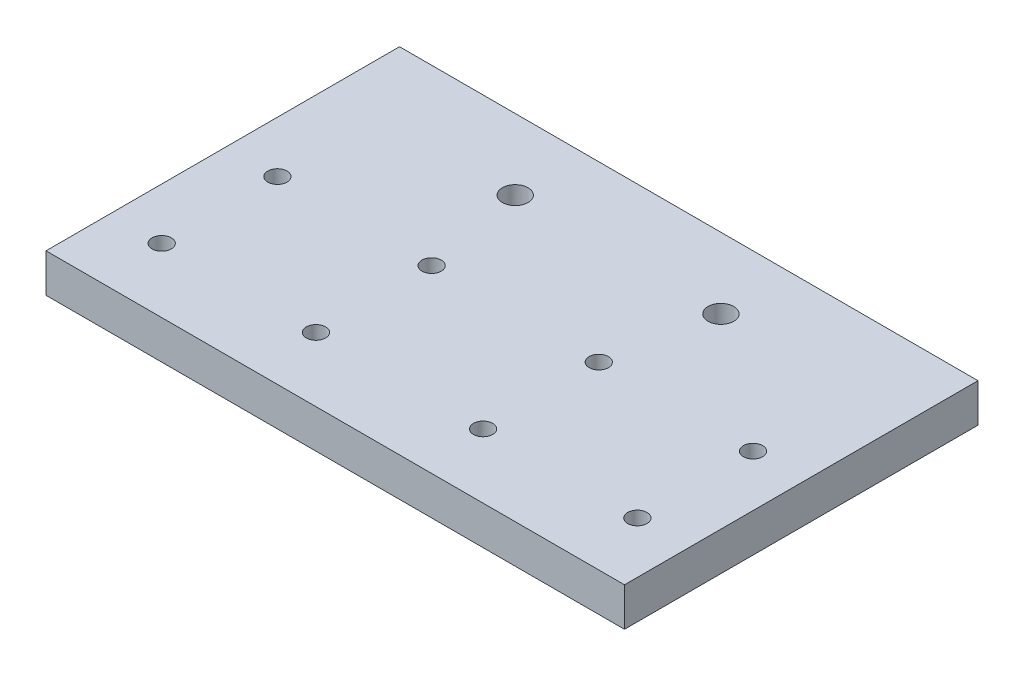
ISO-10303-21;
HEADER;
FILE_DESCRIPTION(('STEP AP214'),'2;1');
FILE_NAME('part.step','',(''),(''),'','','');
FILE_SCHEMA(('AUTOMOTIVE_DESIGN { 1 0 10303 214 1 1 1 1 }'));
ENDSEC;
DATA;
#1=APPLICATION_CONTEXT('core data for automotive mechanical design processes');
#2=APPLICATION_PROTOCOL_DEFINITION('international standard','automotive_design',2000,#1);
#3=PRODUCT_CONTEXT('',#1,'mechanical');
#4=PRODUCT('Part','Part','',(#3));
#5=PRODUCT_RELATED_PRODUCT_CATEGORY('part','',(#4));
#6=PRODUCT_DEFINITION_FORMATION('','',#4);
#7=PRODUCT_DEFINITION_CONTEXT('part definition',#1,'design');
#8=PRODUCT_DEFINITION('design','',#6,#7);
#9=PRODUCT_DEFINITION_SHAPE('','',#8);
#10=(LENGTH_UNIT() NAMED_UNIT(*) SI_UNIT(.MILLI.,.METRE.));
#11=(NAMED_UNIT(*) PLANE_ANGLE_UNIT() SI_UNIT($,.RADIAN.));
#12=(NAMED_UNIT(*) SI_UNIT($,.STERADIAN.) SOLID_ANGLE_UNIT());
#13=UNCERTAINTY_MEASURE_WITH_UNIT(LENGTH_MEASURE(1.E-05),#10,'distance_accuracy_value','');
#14=(GEOMETRIC_REPRESENTATION_CONTEXT(3) GLOBAL_UNCERTAINTY_ASSIGNED_CONTEXT((#13)) GLOBAL_UNIT_ASSIGNED_CONTEXT((#10,
#11,#12)) REPRESENTATION_CONTEXT('',''));
#15=CARTESIAN_POINT('',(0.,0.,0.));
#16=DIRECTION('',(0.,0.,1.));
#17=DIRECTION('',(1.,0.,0.));
#18=AXIS2_PLACEMENT_3D('',#15,#16,#17);
#19=CARTESIAN_POINT('',(0.,6.,0.));
#20=DIRECTION('',(0.,1.,0.));
#21=DIRECTION('',(0.,0.,1.));
#22=AXIS2_PLACEMENT_3D('',#19,#20,#21);
#23=PLANE('',#22);
#24=CARTESIAN_POINT('',(15.999999999977,6.,-18.9999999999857));
#25=DIRECTION('',(0.,1.,0.));
#26=DIRECTION('',(0.,0.,1.));
#27=AXIS2_PLACEMENT_3D('',#24,#25,#26);
#28=CIRCLE('',#27,2.00000000000001);
#29=CARTESIAN_POINT('',(15.999999999977,6.,-16.9999999999857));
#30=VERTEX_POINT('',#29);
#31=EDGE_CURVE('E163',#30,#30,#28,.T.);
#32=ORIENTED_EDGE('',*,*,#31,.F.);
#33=EDGE_LOOP('',(#32));
#34=FACE_BOUND('',#33,.T.);
#35=CARTESIAN_POINT('',(-15.9999999999771,6.,-18.9999999999857));
#36=DIRECTION('',(0.,1.,0.));
#37=DIRECTION('',(0.,0.,-1.));
#38=AXIS2_PLACEMENT_3D('',#35,#36,#37);
#39=CIRCLE('',#38,2.00000000000001);
#40=CARTESIAN_POINT('',(-15.9999999999771,6.,-20.9999999999857));
#41=VERTEX_POINT('',#40);
#42=EDGE_CURVE('E164',#41,#41,#39,.T.);
#43=ORIENTED_EDGE('',*,*,#42,.F.);
#44=EDGE_LOOP('',(#43));
#45=FACE_BOUND('',#44,.T.);
#46=CARTESIAN_POINT('',(-13.0000000000002,6.,15.));
#47=DIRECTION('',(0.,1.,0.));
#48=DIRECTION('',(0.,0.,1.));
#49=AXIS2_PLACEMENT_3D('',#46,#47,#48);
#50=CIRCLE('',#49,1.49999999999746);
#51=CARTESIAN_POINT('',(-13.0000000000002,6.,16.4999999999975));
#52=VERTEX_POINT('',#51);
#53=EDGE_CURVE('E145',#52,#52,#50,.T.);
#54=ORIENTED_EDGE('',*,*,#53,.F.);
#55=EDGE_LOOP('',(#54));
#56=FACE_BOUND('',#55,.T.);
#57=CARTESIAN_POINT('',(-37.0000000000002,6.,15.));
#58=DIRECTION('',(0.,1.,0.));
#59=DIRECTION('',(0.,0.,-1.));
#60=AXIS2_PLACEMENT_3D('',#57,#58,#59);
#61=CIRCLE('',#60,1.5);
#62=CARTESIAN_POINT('',(-37.0000000000002,6.,13.5));
#63=VERTEX_POINT('',#62);
#64=EDGE_CURVE('E133',#63,#63,#61,.T.);
#65=ORIENTED_EDGE('',*,*,#64,.F.);
#66=EDGE_LOOP('',(#65));
#67=FACE_BOUND('',#66,.T.);
#68=CARTESIAN_POINT('',(37.0000000000002,6.,15.));
#69=DIRECTION('',(0.,1.,0.));
#70=DIRECTION('',(0.,0.,1.));
#71=AXIS2_PLACEMENT_3D('',#68,#69,#70);
#72=CIRCLE('',#71,1.5);
#73=CARTESIAN_POINT('',(37.0000000000002,6.,16.5));
#74=VERTEX_POINT('',#73);
#75=EDGE_CURVE('E121',#74,#74,#72,.T.);
#76=ORIENTED_EDGE('',*,*,#75,.F.);
#77=EDGE_LOOP('',(#76));
#78=FACE_BOUND('',#77,.T.);
#79=CARTESIAN_POINT('',(37.,6.,-3.));
#80=DIRECTION('',(0.,1.,0.));
#81=DIRECTION('',(0.,0.,1.));
#82=AXIS2_PLACEMENT_3D('',#79,#80,#81);
#83=CIRCLE('',#82,1.5);
#84=CARTESIAN_POINT('',(37.,6.,-1.49999999999999));
#85=VERTEX_POINT('',#84);
#86=EDGE_CURVE('E100',#85,#85,#83,.T.);
#87=ORIENTED_EDGE('',*,*,#86,.F.);
#88=EDGE_LOOP('',(#87));
#89=FACE_BOUND('',#88,.T.);
#90=DIRECTION('',(0.,0.,-1.));
#91=VECTOR('',#90,1.);
#92=CARTESIAN_POINT('',(45.,6.,-30.));
#93=LINE('',#92,#91);
#94=CARTESIAN_POINT('',(45.,6.,25.));
#95=VERTEX_POINT('',#94);
#96=CARTESIAN_POINT('',(45.,6.,-30.));
#97=VERTEX_POINT('',#96);
#98=EDGE_CURVE('E85',#95,#97,#93,.T.);
#99=ORIENTED_EDGE('',*,*,#98,.T.);
#100=DIRECTION('',(-1.,0.,0.));
#101=VECTOR('',#100,1.);
#102=CARTESIAN_POINT('',(-45.,6.,-30.));
#103=LINE('',#102,#101);
#104=CARTESIAN_POINT('',(-45.,6.,-30.));
#105=VERTEX_POINT('',#104);
#106=EDGE_CURVE('E80',#97,#105,#103,.T.);
#107=ORIENTED_EDGE('',*,*,#106,.T.);
#108=DIRECTION('',(0.,0.,1.));
#109=VECTOR('',#108,1.);
#110=CARTESIAN_POINT('',(-45.,6.,-30.));
#111=LINE('',#110,#109);
#112=CARTESIAN_POINT('',(-45.,6.,25.));
#113=VERTEX_POINT('',#112);
#114=EDGE_CURVE('E83',#105,#113,#111,.T.);
#115=ORIENTED_EDGE('',*,*,#114,.T.);
#116=DIRECTION('',(1.,0.,0.));
#117=VECTOR('',#116,1.);
#118=CARTESIAN_POINT('',(-45.,6.,25.));
#119=LINE('',#118,#117);
#120=EDGE_CURVE('E50',#113,#95,#119,.T.);
#121=ORIENTED_EDGE('',*,*,#120,.T.);
#122=EDGE_LOOP('',(#99,#107,#115,#121));
#123=FACE_BOUND('',#122,.T.);
#124=CARTESIAN_POINT('',(13.,6.,-3.));
#125=DIRECTION('',(0.,1.,0.));
#126=DIRECTION('',(0.,0.,-1.));
#127=AXIS2_PLACEMENT_3D('',#124,#125,#126);
#128=CIRCLE('',#127,1.49999999999747);
#129=CARTESIAN_POINT('',(13.,6.,-4.49999999999747));
#130=VERTEX_POINT('',#129);
#131=EDGE_CURVE('E115',#130,#130,#128,.T.);
#132=ORIENTED_EDGE('',*,*,#131,.F.);
#133=EDGE_LOOP('',(#132));
#134=FACE_BOUND('',#133,.T.);
#135=CARTESIAN_POINT('',(13.0000000000002,6.,15.));
#136=DIRECTION('',(0.,1.,0.));
#137=DIRECTION('',(0.,0.,-1.));
#138=AXIS2_PLACEMENT_3D('',#135,#136,#137);
#139=CIRCLE('',#138,1.49999999999747);
#140=CARTESIAN_POINT('',(13.0000000000002,6.,13.5000000000025));
#141=VERTEX_POINT('',#140);
#142=EDGE_CURVE('E127',#141,#141,#139,.T.);
#143=ORIENTED_EDGE('',*,*,#142,.F.);
#144=EDGE_LOOP('',(#143));
#145=FACE_BOUND('',#144,.T.);
#146=CARTESIAN_POINT('',(-37.,6.,-3.));
#147=DIRECTION('',(0.,1.,0.));
#148=DIRECTION('',(0.,0.,-1.));
#149=AXIS2_PLACEMENT_3D('',#146,#147,#148);
#150=CIRCLE('',#149,1.5);
#151=CARTESIAN_POINT('',(-37.,6.,-4.5));
#152=VERTEX_POINT('',#151);
#153=EDGE_CURVE('E139',#152,#152,#150,.T.);
#154=ORIENTED_EDGE('',*,*,#153,.F.);
#155=EDGE_LOOP('',(#154));
#156=FACE_BOUND('',#155,.T.);
#157=CARTESIAN_POINT('',(-13.,6.,-3.));
#158=DIRECTION('',(0.,1.,0.));
#159=DIRECTION('',(0.,0.,1.));
#160=AXIS2_PLACEMENT_3D('',#157,#158,#159);
#161=CIRCLE('',#160,1.49999999999746);
#162=CARTESIAN_POINT('',(-13.,6.,-1.50000000000253));
#163=VERTEX_POINT('',#162);
#164=EDGE_CURVE('E151',#163,#163,#161,.T.);
#165=ORIENTED_EDGE('',*,*,#164,.F.);
#166=EDGE_LOOP('',(#165));
#167=FACE_BOUND('',#166,.T.);
#168=ADVANCED_FACE('F33',(#34,#45,#56,#67,#78,#89,#123,#134,#145,#156,#167),#23,.T.);
#169=CARTESIAN_POINT('',(0.,0.,0.));
#170=DIRECTION('',(0.,1.,0.));
#171=DIRECTION('',(0.,0.,1.));
#172=AXIS2_PLACEMENT_3D('',#169,#170,#171);
#173=PLANE('',#172);
#174=CARTESIAN_POINT('',(15.999999999977,0.,-18.9999999999857));
#175=DIRECTION('',(0.,1.,0.));
#176=DIRECTION('',(0.,0.,1.));
#177=AXIS2_PLACEMENT_3D('',#174,#175,#176);
#178=CIRCLE('',#177,2.00000000000001);
#179=CARTESIAN_POINT('',(15.999999999977,0.,-16.9999999999857));
#180=VERTEX_POINT('',#179);
#181=EDGE_CURVE('E157',#180,#180,#178,.F.);
#182=ORIENTED_EDGE('',*,*,#181,.F.);
#183=EDGE_LOOP('',(#182));
#184=FACE_BOUND('',#183,.T.);
#185=CARTESIAN_POINT('',(-15.9999999999771,0.,-18.9999999999857));
#186=DIRECTION('',(0.,1.,0.));
#187=DIRECTION('',(0.,0.,1.));
#188=AXIS2_PLACEMENT_3D('',#185,#186,#187);
#189=CIRCLE('',#188,2.00000000000001);
#190=CARTESIAN_POINT('',(-15.9999999999771,0.,-16.9999999999857));
#191=VERTEX_POINT('',#190);
#192=EDGE_CURVE('E160',#191,#191,#189,.F.);
#193=ORIENTED_EDGE('',*,*,#192,.F.);
#194=EDGE_LOOP('',(#193));
#195=FACE_BOUND('',#194,.T.);
#196=DIRECTION('',(0.,0.,-1.));
#197=VECTOR('',#196,1.);
#198=CARTESIAN_POINT('',(45.,0.,-30.));
#199=LINE('',#198,#197);
#200=CARTESIAN_POINT('',(45.,0.,25.));
#201=VERTEX_POINT('',#200);
#202=CARTESIAN_POINT('',(45.,0.,-30.));
#203=VERTEX_POINT('',#202);
#204=EDGE_CURVE('E97',#201,#203,#199,.T.);
#205=ORIENTED_EDGE('',*,*,#204,.F.);
#206=DIRECTION('',(1.,0.,0.));
#207=VECTOR('',#206,1.);
#208=CARTESIAN_POINT('',(-45.,0.,25.));
#209=LINE('',#208,#207);
#210=CARTESIAN_POINT('',(-45.,0.,25.));
#211=VERTEX_POINT('',#210);
#212=EDGE_CURVE('E73',#211,#201,#209,.T.);
#213=ORIENTED_EDGE('',*,*,#212,.F.);
#214=DIRECTION('',(0.,0.,1.));
#215=VECTOR('',#214,1.);
#216=CARTESIAN_POINT('',(-45.,0.,-30.));
#217=LINE('',#216,#215);
#218=CARTESIAN_POINT('',(-45.,0.,-30.));
#219=VERTEX_POINT('',#218);
#220=EDGE_CURVE('E67',#219,#211,#217,.T.);
#221=ORIENTED_EDGE('',*,*,#220,.F.);
#222=DIRECTION('',(-1.,0.,0.));
#223=VECTOR('',#222,1.);
#224=CARTESIAN_POINT('',(-45.,0.,-30.));
#225=LINE('',#224,#223);
#226=EDGE_CURVE('E89',#203,#219,#225,.T.);
#227=ORIENTED_EDGE('',*,*,#226,.F.);
#228=EDGE_LOOP('',(#205,#213,#221,#227));
#229=FACE_BOUND('',#228,.T.);
#230=CARTESIAN_POINT('',(37.,0.,-3.));
#231=DIRECTION('',(0.,1.,0.));
#232=DIRECTION('',(0.,0.,1.));
#233=AXIS2_PLACEMENT_3D('',#230,#231,#232);
#234=CIRCLE('',#233,1.5);
#235=CARTESIAN_POINT('',(37.,0.,-1.49999999999999));
#236=VERTEX_POINT('',#235);
#237=EDGE_CURVE('E112',#236,#236,#234,.T.);
#238=ORIENTED_EDGE('',*,*,#237,.T.);
#239=EDGE_LOOP('',(#238));
#240=FACE_BOUND('',#239,.T.);
#241=CARTESIAN_POINT('',(13.,0.,-3.));
#242=DIRECTION('',(0.,1.,0.));
#243=DIRECTION('',(0.,0.,-1.));
#244=AXIS2_PLACEMENT_3D('',#241,#242,#243);
#245=CIRCLE('',#244,1.49999999999747);
#246=CARTESIAN_POINT('',(13.,0.,-4.49999999999747));
#247=VERTEX_POINT('',#246);
#248=EDGE_CURVE('E118',#247,#247,#245,.T.);
#249=ORIENTED_EDGE('',*,*,#248,.T.);
#250=EDGE_LOOP('',(#249));
#251=FACE_BOUND('',#250,.T.);
#252=CARTESIAN_POINT('',(37.0000000000002,0.,15.));
#253=DIRECTION('',(0.,1.,0.));
#254=DIRECTION('',(0.,0.,1.));
#255=AXIS2_PLACEMENT_3D('',#252,#253,#254);
#256=CIRCLE('',#255,1.5);
#257=CARTESIAN_POINT('',(37.0000000000002,0.,16.5));
#258=VERTEX_POINT('',#257);
#259=EDGE_CURVE('E124',#258,#258,#256,.T.);
#260=ORIENTED_EDGE('',*,*,#259,.T.);
#261=EDGE_LOOP('',(#260));
#262=FACE_BOUND('',#261,.T.);
#263=CARTESIAN_POINT('',(13.0000000000002,0.,15.));
#264=DIRECTION('',(0.,1.,0.));
#265=DIRECTION('',(0.,0.,-1.));
#266=AXIS2_PLACEMENT_3D('',#263,#264,#265);
#267=CIRCLE('',#266,1.49999999999747);
#268=CARTESIAN_POINT('',(13.0000000000002,0.,13.5000000000025));
#269=VERTEX_POINT('',#268);
#270=EDGE_CURVE('E130',#269,#269,#267,.T.);
#271=ORIENTED_EDGE('',*,*,#270,.T.);
#272=EDGE_LOOP('',(#271));
#273=FACE_BOUND('',#272,.T.);
#274=CARTESIAN_POINT('',(-37.0000000000002,0.,15.));
#275=DIRECTION('',(0.,1.,0.));
#276=DIRECTION('',(0.,0.,-1.));
#277=AXIS2_PLACEMENT_3D('',#274,#275,#276);
#278=CIRCLE('',#277,1.5);
#279=CARTESIAN_POINT('',(-37.0000000000002,0.,13.5));
#280=VERTEX_POINT('',#279);
#281=EDGE_CURVE('E136',#280,#280,#278,.T.);
#282=ORIENTED_EDGE('',*,*,#281,.T.);
#283=EDGE_LOOP('',(#282));
#284=FACE_BOUND('',#283,.T.);
#285=CARTESIAN_POINT('',(-37.,0.,-3.));
#286=DIRECTION('',(0.,1.,0.));
#287=DIRECTION('',(0.,0.,-1.));
#288=AXIS2_PLACEMENT_3D('',#285,#286,#287);
#289=CIRCLE('',#288,1.5);
#290=CARTESIAN_POINT('',(-37.,0.,-4.5));
#291=VERTEX_POINT('',#290);
#292=EDGE_CURVE('E142',#291,#291,#289,.T.);
#293=ORIENTED_EDGE('',*,*,#292,.T.);
#294=EDGE_LOOP('',(#293));
#295=FACE_BOUND('',#294,.T.);
#296=CARTESIAN_POINT('',(-13.0000000000002,0.,15.));
#297=DIRECTION('',(0.,1.,0.));
#298=DIRECTION('',(0.,0.,1.));
#299=AXIS2_PLACEMENT_3D('',#296,#297,#298);
#300=CIRCLE('',#299,1.49999999999746);
#301=CARTESIAN_POINT('',(-13.0000000000002,0.,16.4999999999975));
#302=VERTEX_POINT('',#301);
#303=EDGE_CURVE('E148',#302,#302,#300,.T.);
#304=ORIENTED_EDGE('',*,*,#303,.T.);
#305=EDGE_LOOP('',(#304));
#306=FACE_BOUND('',#305,.T.);
#307=CARTESIAN_POINT('',(-13.,0.,-3.));
#308=DIRECTION('',(0.,1.,0.));
#309=DIRECTION('',(0.,0.,1.));
#310=AXIS2_PLACEMENT_3D('',#307,#308,#309);
#311=CIRCLE('',#310,1.49999999999746);
#312=CARTESIAN_POINT('',(-13.,0.,-1.50000000000253));
#313=VERTEX_POINT('',#312);
#314=EDGE_CURVE('E154',#313,#313,#311,.T.);
#315=ORIENTED_EDGE('',*,*,#314,.T.);
#316=EDGE_LOOP('',(#315));
#317=FACE_BOUND('',#316,.T.);
#318=ADVANCED_FACE('F108',(#184,#195,#229,#240,#251,#262,#273,#284,#295,#306,#317),#173,.F.);
#319=CARTESIAN_POINT('',(45.,6.,-30.));
#320=DIRECTION('',(-1.,0.,0.));
#321=DIRECTION('',(0.,0.,1.));
#322=AXIS2_PLACEMENT_3D('',#319,#320,#321);
#323=PLANE('',#322);
#324=ORIENTED_EDGE('',*,*,#204,.T.);
#325=DIRECTION('',(0.,-1.,0.));
#326=VECTOR('',#325,1.);
#327=CARTESIAN_POINT('',(45.,6.,-30.));
#328=LINE('',#327,#326);
#329=EDGE_CURVE('E11',#97,#203,#328,.T.);
#330=ORIENTED_EDGE('',*,*,#329,.F.);
#331=ORIENTED_EDGE('',*,*,#98,.F.);
#332=DIRECTION('',(0.,-1.,0.));
#333=VECTOR('',#332,1.);
#334=CARTESIAN_POINT('',(45.,6.,25.));
#335=LINE('',#334,#333);
#336=EDGE_CURVE('E93',#95,#201,#335,.T.);
#337=ORIENTED_EDGE('',*,*,#336,.T.);
#338=EDGE_LOOP('',(#324,#330,#331,#337));
#339=FACE_BOUND('',#338,.T.);
#340=ADVANCED_FACE('F35',(#339),#323,.F.);
#341=CARTESIAN_POINT('',(-45.,6.,-30.));
#342=DIRECTION('',(0.,0.,1.));
#343=DIRECTION('',(1.,0.,0.));
#344=AXIS2_PLACEMENT_3D('',#341,#342,#343);
#345=PLANE('',#344);
#346=ORIENTED_EDGE('',*,*,#226,.T.);
#347=DIRECTION('',(0.,-1.,0.));
#348=VECTOR('',#347,1.);
#349=CARTESIAN_POINT('',(-45.,6.,-30.));
#350=LINE('',#349,#348);
#351=EDGE_CURVE('E42',#105,#219,#350,.T.);
#352=ORIENTED_EDGE('',*,*,#351,.F.);
#353=ORIENTED_EDGE('',*,*,#106,.F.);
#354=ORIENTED_EDGE('',*,*,#329,.T.);
#355=EDGE_LOOP('',(#346,#352,#353,#354));
#356=FACE_BOUND('',#355,.T.);
#357=ADVANCED_FACE('F88',(#356),#345,.F.);
#358=CARTESIAN_POINT('',(-45.,6.,-30.));
#359=DIRECTION('',(1.,0.,0.));
#360=DIRECTION('',(0.,0.,-1.));
#361=AXIS2_PLACEMENT_3D('',#358,#359,#360);
#362=PLANE('',#361);
#363=ORIENTED_EDGE('',*,*,#220,.T.);
#364=DIRECTION('',(0.,-1.,0.));
#365=VECTOR('',#364,1.);
#366=CARTESIAN_POINT('',(-45.,6.,25.));
#367=LINE('',#366,#365);
#368=EDGE_CURVE('E90',#113,#211,#367,.T.);
#369=ORIENTED_EDGE('',*,*,#368,.F.);
#370=ORIENTED_EDGE('',*,*,#114,.F.);
#371=ORIENTED_EDGE('',*,*,#351,.T.);
#372=EDGE_LOOP('',(#363,#369,#370,#371));
#373=FACE_BOUND('',#372,.T.);
#374=ADVANCED_FACE('F91',(#373),#362,.F.);
#375=CARTESIAN_POINT('',(-45.,6.,25.));
#376=DIRECTION('',(0.,0.,-1.));
#377=DIRECTION('',(-1.,0.,0.));
#378=AXIS2_PLACEMENT_3D('',#375,#376,#377);
#379=PLANE('',#378);
#380=ORIENTED_EDGE('',*,*,#212,.T.);
#381=ORIENTED_EDGE('',*,*,#336,.F.);
#382=ORIENTED_EDGE('',*,*,#120,.F.);
#383=ORIENTED_EDGE('',*,*,#368,.T.);
#384=EDGE_LOOP('',(#380,#381,#382,#383));
#385=FACE_BOUND('',#384,.T.);
#386=ADVANCED_FACE('F105',(#385),#379,.F.);
#387=CARTESIAN_POINT('',(37.,6.,-3.));
#388=DIRECTION('',(0.,-1.,0.));
#389=DIRECTION('',(0.,0.,-1.));
#390=AXIS2_PLACEMENT_3D('',#387,#388,#389);
#391=CYLINDRICAL_SURFACE('',#390,1.5);
#392=ORIENTED_EDGE('',*,*,#86,.T.);
#393=EDGE_LOOP('',(#392));
#394=FACE_BOUND('',#393,.T.);
#395=ORIENTED_EDGE('',*,*,#237,.F.);
#396=EDGE_LOOP('',(#395));
#397=FACE_BOUND('',#396,.T.);
#398=ADVANCED_FACE('F188',(#394,#397),#391,.F.);
#399=CARTESIAN_POINT('',(13.,6.,-3.));
#400=DIRECTION('',(0.,-1.,0.));
#401=DIRECTION('',(0.,0.,-1.));
#402=AXIS2_PLACEMENT_3D('',#399,#400,#401);
#403=CYLINDRICAL_SURFACE('',#402,1.49999999999747);
#404=ORIENTED_EDGE('',*,*,#131,.T.);
#405=EDGE_LOOP('',(#404));
#406=FACE_BOUND('',#405,.T.);
#407=ORIENTED_EDGE('',*,*,#248,.F.);
#408=EDGE_LOOP('',(#407));
#409=FACE_BOUND('',#408,.T.);
#410=ADVANCED_FACE('F191',(#406,#409),#403,.F.);
#411=CARTESIAN_POINT('',(37.0000000000002,6.,15.));
#412=DIRECTION('',(0.,-1.,0.));
#413=DIRECTION('',(0.,0.,-1.));
#414=AXIS2_PLACEMENT_3D('',#411,#412,#413);
#415=CYLINDRICAL_SURFACE('',#414,1.5);
#416=ORIENTED_EDGE('',*,*,#75,.T.);
#417=EDGE_LOOP('',(#416));
#418=FACE_BOUND('',#417,.T.);
#419=ORIENTED_EDGE('',*,*,#259,.F.);
#420=EDGE_LOOP('',(#419));
#421=FACE_BOUND('',#420,.T.);
#422=ADVANCED_FACE('F239',(#418,#421),#415,.F.);
#423=CARTESIAN_POINT('',(13.0000000000002,6.,15.));
#424=DIRECTION('',(0.,-1.,0.));
#425=DIRECTION('',(0.,0.,-1.));
#426=AXIS2_PLACEMENT_3D('',#423,#424,#425);
#427=CYLINDRICAL_SURFACE('',#426,1.49999999999747);
#428=ORIENTED_EDGE('',*,*,#142,.T.);
#429=EDGE_LOOP('',(#428));
#430=FACE_BOUND('',#429,.T.);
#431=ORIENTED_EDGE('',*,*,#270,.F.);
#432=EDGE_LOOP('',(#431));
#433=FACE_BOUND('',#432,.T.);
#434=ADVANCED_FACE('F235',(#430,#433),#427,.F.);
#435=CARTESIAN_POINT('',(-37.0000000000002,6.,15.));
#436=DIRECTION('',(0.,-1.,0.));
#437=DIRECTION('',(0.,0.,-1.));
#438=AXIS2_PLACEMENT_3D('',#435,#436,#437);
#439=CYLINDRICAL_SURFACE('',#438,1.5);
#440=ORIENTED_EDGE('',*,*,#64,.T.);
#441=EDGE_LOOP('',(#440));
#442=FACE_BOUND('',#441,.T.);
#443=ORIENTED_EDGE('',*,*,#281,.F.);
#444=EDGE_LOOP('',(#443));
#445=FACE_BOUND('',#444,.T.);
#446=ADVANCED_FACE('F231',(#442,#445),#439,.F.);
#447=CARTESIAN_POINT('',(-37.,6.,-3.));
#448=DIRECTION('',(0.,-1.,0.));
#449=DIRECTION('',(0.,0.,-1.));
#450=AXIS2_PLACEMENT_3D('',#447,#448,#449);
#451=CYLINDRICAL_SURFACE('',#450,1.5);
#452=ORIENTED_EDGE('',*,*,#153,.T.);
#453=EDGE_LOOP('',(#452));
#454=FACE_BOUND('',#453,.T.);
#455=ORIENTED_EDGE('',*,*,#292,.F.);
#456=EDGE_LOOP('',(#455));
#457=FACE_BOUND('',#456,.T.);
#458=ADVANCED_FACE('F224',(#454,#457),#451,.F.);
#459=CARTESIAN_POINT('',(-13.0000000000002,6.,15.));
#460=DIRECTION('',(0.,-1.,0.));
#461=DIRECTION('',(0.,0.,-1.));
#462=AXIS2_PLACEMENT_3D('',#459,#460,#461);
#463=CYLINDRICAL_SURFACE('',#462,1.49999999999746);
#464=ORIENTED_EDGE('',*,*,#53,.T.);
#465=EDGE_LOOP('',(#464));
#466=FACE_BOUND('',#465,.T.);
#467=ORIENTED_EDGE('',*,*,#303,.F.);
#468=EDGE_LOOP('',(#467));
#469=FACE_BOUND('',#468,.T.);
#470=ADVANCED_FACE('F215',(#466,#469),#463,.F.);
#471=CARTESIAN_POINT('',(-13.,6.,-3.));
#472=DIRECTION('',(0.,-1.,0.));
#473=DIRECTION('',(0.,0.,-1.));
#474=AXIS2_PLACEMENT_3D('',#471,#472,#473);
#475=CYLINDRICAL_SURFACE('',#474,1.49999999999746);
#476=ORIENTED_EDGE('',*,*,#164,.T.);
#477=EDGE_LOOP('',(#476));
#478=FACE_BOUND('',#477,.T.);
#479=ORIENTED_EDGE('',*,*,#314,.F.);
#480=EDGE_LOOP('',(#479));
#481=FACE_BOUND('',#480,.T.);
#482=ADVANCED_FACE('F212',(#478,#481),#475,.F.);
#483=CARTESIAN_POINT('',(-15.9999999999771,-0.00100000000000013,-18.9999999999857));
#484=DIRECTION('',(0.,1.,0.));
#485=DIRECTION('',(0.,0.,1.));
#486=AXIS2_PLACEMENT_3D('',#483,#484,#485);
#487=CYLINDRICAL_SURFACE('',#486,2.00000000000001);
#488=ORIENTED_EDGE('',*,*,#42,.T.);
#489=EDGE_LOOP('',(#488));
#490=FACE_BOUND('',#489,.T.);
#491=ORIENTED_EDGE('',*,*,#192,.T.);
#492=EDGE_LOOP('',(#491));
#493=FACE_BOUND('',#492,.T.);
#494=ADVANCED_FACE('F214',(#490,#493),#487,.F.);
#495=CARTESIAN_POINT('',(15.999999999977,-0.00100000000000013,-18.9999999999857));
#496=DIRECTION('',(0.,1.,0.));
#497=DIRECTION('',(0.,0.,1.));
#498=AXIS2_PLACEMENT_3D('',#495,#496,#497);
#499=CYLINDRICAL_SURFACE('',#498,2.00000000000001);
#500=ORIENTED_EDGE('',*,*,#31,.T.);
#501=EDGE_LOOP('',(#500));
#502=FACE_BOUND('',#501,.T.);
#503=ORIENTED_EDGE('',*,*,#181,.T.);
#504=EDGE_LOOP('',(#503));
#505=FACE_BOUND('',#504,.T.);
#506=ADVANCED_FACE('F172',(#502,#505),#499,.F.);
#507=CLOSED_SHELL('',(#168,#318,#340,#357,#374,#386,#398,#410,#422,#434,#446,#458,#470,#482,
#494,#506));
#508=MANIFOLD_SOLID_BREP('B2',#507);
#509=ADVANCED_BREP_SHAPE_REPRESENTATION('',(#18,#508),#14);
#510=SHAPE_DEFINITION_REPRESENTATION(#9,#509);
ENDSEC;
END-ISO-10303-21;
